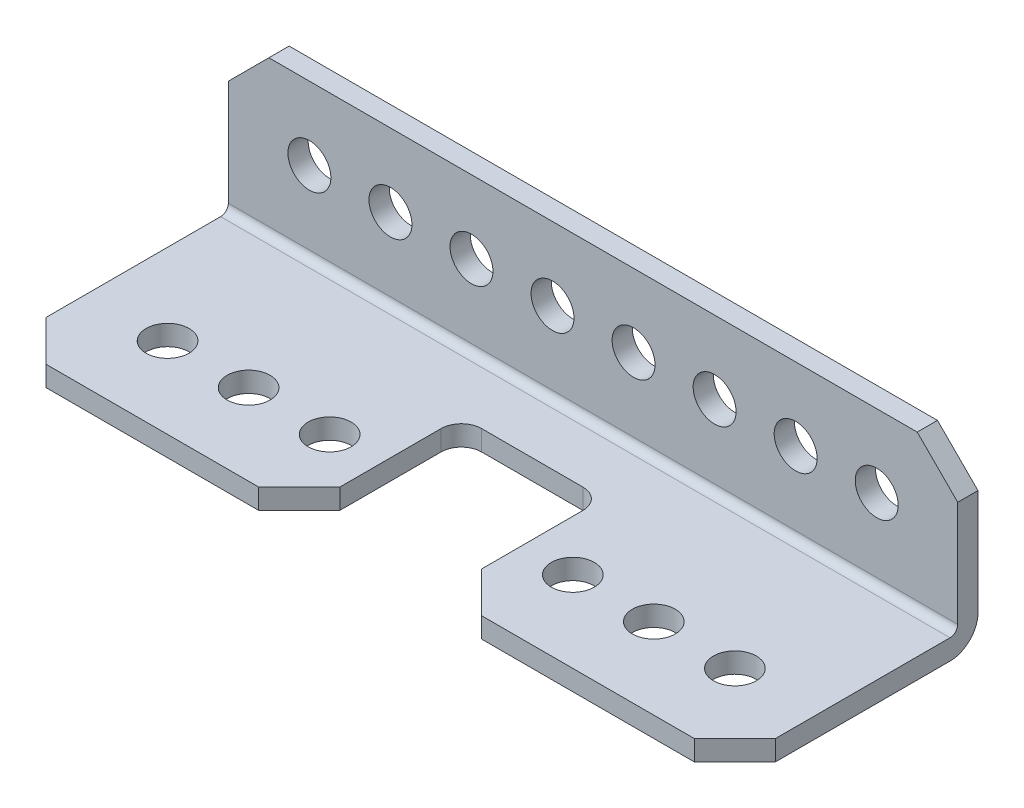
ISO-10303-21;
HEADER;
FILE_DESCRIPTION(('STEP AP214'),'2;1');
FILE_NAME('part.step','',(''),(''),'','','');
FILE_SCHEMA(('AUTOMOTIVE_DESIGN { 1 0 10303 214 1 1 1 1 }'));
ENDSEC;
DATA;
#1=APPLICATION_CONTEXT('core data for automotive mechanical design processes');
#2=APPLICATION_PROTOCOL_DEFINITION('international standard','automotive_design',2000,#1);
#3=PRODUCT_CONTEXT('',#1,'mechanical');
#4=PRODUCT('Part','Part','',(#3));
#5=PRODUCT_RELATED_PRODUCT_CATEGORY('part','',(#4));
#6=PRODUCT_DEFINITION_FORMATION('','',#4);
#7=PRODUCT_DEFINITION_CONTEXT('part definition',#1,'design');
#8=PRODUCT_DEFINITION('design','',#6,#7);
#9=PRODUCT_DEFINITION_SHAPE('','',#8);
#10=(LENGTH_UNIT() NAMED_UNIT(*) SI_UNIT(.MILLI.,.METRE.));
#11=(NAMED_UNIT(*) PLANE_ANGLE_UNIT() SI_UNIT($,.RADIAN.));
#12=(NAMED_UNIT(*) SI_UNIT($,.STERADIAN.) SOLID_ANGLE_UNIT());
#13=UNCERTAINTY_MEASURE_WITH_UNIT(LENGTH_MEASURE(1.E-05),#10,'distance_accuracy_value','');
#14=(GEOMETRIC_REPRESENTATION_CONTEXT(3) GLOBAL_UNCERTAINTY_ASSIGNED_CONTEXT((#13)) GLOBAL_UNIT_ASSIGNED_CONTEXT((#10,
#11,#12)) REPRESENTATION_CONTEXT('',''));
#15=CARTESIAN_POINT('',(0.,0.,0.));
#16=DIRECTION('',(0.,0.,1.));
#17=DIRECTION('',(1.,0.,0.));
#18=AXIS2_PLACEMENT_3D('',#15,#16,#17);
#19=CARTESIAN_POINT('',(-57.15,-12.065,0.));
#20=DIRECTION('',(0.,0.,1.));
#21=DIRECTION('',(1.,0.,0.));
#22=AXIS2_PLACEMENT_3D('',#19,#20,#21);
#23=PLANE('',#22);
#24=DIRECTION('',(0.707106781186548,-0.707106781186547,0.));
#25=VECTOR('',#24,1.);
#26=CARTESIAN_POINT('',(50.8,12.065,0.));
#27=LINE('',#26,#25);
#28=CARTESIAN_POINT('',(50.8,12.065,0.));
#29=VERTEX_POINT('',#28);
#30=CARTESIAN_POINT('',(57.15,5.71500000000001,0.));
#31=VERTEX_POINT('',#30);
#32=EDGE_CURVE('E156',#29,#31,#27,.T.);
#33=ORIENTED_EDGE('',*,*,#32,.T.);
#34=DIRECTION('',(0.,1.,0.));
#35=VECTOR('',#34,1.);
#36=CARTESIAN_POINT('',(57.15,12.065,0.));
#37=LINE('',#36,#35);
#38=CARTESIAN_POINT('',(57.15,-10.8458,0.));
#39=VERTEX_POINT('',#38);
#40=EDGE_CURVE('E150',#31,#39,#37,.F.);
#41=ORIENTED_EDGE('',*,*,#40,.T.);
#42=DIRECTION('',(1.,0.,0.));
#43=VECTOR('',#42,1.);
#44=CARTESIAN_POINT('',(57.15,-10.8458,0.));
#45=LINE('',#44,#43);
#46=CARTESIAN_POINT('',(-57.15,-10.8458,0.));
#47=VERTEX_POINT('',#46);
#48=EDGE_CURVE('E153',#47,#39,#45,.T.);
#49=ORIENTED_EDGE('',*,*,#48,.F.);
#50=DIRECTION('',(0.,1.,0.));
#51=VECTOR('',#50,1.);
#52=CARTESIAN_POINT('',(-57.15,12.065,0.));
#53=LINE('',#52,#51);
#54=CARTESIAN_POINT('',(-57.15,5.715,0.));
#55=VERTEX_POINT('',#54);
#56=EDGE_CURVE('E474',#47,#55,#53,.T.);
#57=ORIENTED_EDGE('',*,*,#56,.T.);
#58=DIRECTION('',(0.707106781186548,0.707106781186547,0.));
#59=VECTOR('',#58,1.);
#60=CARTESIAN_POINT('',(-57.15,5.715,0.));
#61=LINE('',#60,#59);
#62=CARTESIAN_POINT('',(-50.8,12.065,0.));
#63=VERTEX_POINT('',#62);
#64=EDGE_CURVE('E449',#55,#63,#61,.T.);
#65=ORIENTED_EDGE('',*,*,#64,.T.);
#66=DIRECTION('',(1.,0.,0.));
#67=VECTOR('',#66,1.);
#68=CARTESIAN_POINT('',(-57.15,12.065,0.));
#69=LINE('',#68,#67);
#70=EDGE_CURVE('E444',#63,#29,#69,.T.);
#71=ORIENTED_EDGE('',*,*,#70,.T.);
#72=EDGE_LOOP('',(#33,#41,#49,#57,#65,#71));
#73=FACE_BOUND('',#72,.T.);
#74=CARTESIAN_POINT('',(-44.45,0.634999999999998,0.));
#75=DIRECTION('',(0.,0.,1.));
#76=DIRECTION('',(1.,0.,0.));
#77=AXIS2_PLACEMENT_3D('',#74,#75,#76);
#78=CIRCLE('',#77,3.3655);
#79=CARTESIAN_POINT('',(-41.0845,0.634999999999998,0.));
#80=VERTEX_POINT('',#79);
#81=EDGE_CURVE('E160',#80,#80,#78,.T.);
#82=ORIENTED_EDGE('',*,*,#81,.T.);
#83=EDGE_LOOP('',(#82));
#84=FACE_BOUND('',#83,.T.);
#85=CARTESIAN_POINT('',(-31.75,0.634999999999998,0.));
#86=DIRECTION('',(0.,0.,1.));
#87=DIRECTION('',(1.,0.,0.));
#88=AXIS2_PLACEMENT_3D('',#85,#86,#87);
#89=CIRCLE('',#88,3.36549999999999);
#90=CARTESIAN_POINT('',(-28.3845,0.634999999999998,0.));
#91=VERTEX_POINT('',#90);
#92=EDGE_CURVE('E185',#91,#91,#89,.T.);
#93=ORIENTED_EDGE('',*,*,#92,.T.);
#94=EDGE_LOOP('',(#93));
#95=FACE_BOUND('',#94,.T.);
#96=CARTESIAN_POINT('',(-19.05,0.634999999999998,0.));
#97=DIRECTION('',(0.,0.,1.));
#98=DIRECTION('',(1.,0.,0.));
#99=AXIS2_PLACEMENT_3D('',#96,#97,#98);
#100=CIRCLE('',#99,3.3655);
#101=CARTESIAN_POINT('',(-15.6845,0.634999999999998,0.));
#102=VERTEX_POINT('',#101);
#103=EDGE_CURVE('E188',#102,#102,#100,.T.);
#104=ORIENTED_EDGE('',*,*,#103,.T.);
#105=EDGE_LOOP('',(#104));
#106=FACE_BOUND('',#105,.T.);
#107=CARTESIAN_POINT('',(-6.35,0.634999999999998,0.));
#108=DIRECTION('',(0.,0.,1.));
#109=DIRECTION('',(1.,0.,0.));
#110=AXIS2_PLACEMENT_3D('',#107,#108,#109);
#111=CIRCLE('',#110,3.3655);
#112=CARTESIAN_POINT('',(-2.9845,0.634999999999998,0.));
#113=VERTEX_POINT('',#112);
#114=EDGE_CURVE('E191',#113,#113,#111,.T.);
#115=ORIENTED_EDGE('',*,*,#114,.T.);
#116=EDGE_LOOP('',(#115));
#117=FACE_BOUND('',#116,.T.);
#118=CARTESIAN_POINT('',(6.35,0.634999999999998,0.));
#119=DIRECTION('',(0.,0.,1.));
#120=DIRECTION('',(1.,0.,0.));
#121=AXIS2_PLACEMENT_3D('',#118,#119,#120);
#122=CIRCLE('',#121,3.3655);
#123=CARTESIAN_POINT('',(9.7155,0.634999999999998,0.));
#124=VERTEX_POINT('',#123);
#125=EDGE_CURVE('E194',#124,#124,#122,.T.);
#126=ORIENTED_EDGE('',*,*,#125,.T.);
#127=EDGE_LOOP('',(#126));
#128=FACE_BOUND('',#127,.T.);
#129=CARTESIAN_POINT('',(19.05,0.634999999999998,0.));
#130=DIRECTION('',(0.,0.,1.));
#131=DIRECTION('',(1.,0.,0.));
#132=AXIS2_PLACEMENT_3D('',#129,#130,#131);
#133=CIRCLE('',#132,3.3655);
#134=CARTESIAN_POINT('',(22.4155,0.634999999999998,0.));
#135=VERTEX_POINT('',#134);
#136=EDGE_CURVE('E197',#135,#135,#133,.T.);
#137=ORIENTED_EDGE('',*,*,#136,.T.);
#138=EDGE_LOOP('',(#137));
#139=FACE_BOUND('',#138,.T.);
#140=CARTESIAN_POINT('',(31.75,0.634999999999998,0.));
#141=DIRECTION('',(0.,0.,1.));
#142=DIRECTION('',(1.,0.,0.));
#143=AXIS2_PLACEMENT_3D('',#140,#141,#142);
#144=CIRCLE('',#143,3.3655);
#145=CARTESIAN_POINT('',(35.1155,0.634999999999998,0.));
#146=VERTEX_POINT('',#145);
#147=EDGE_CURVE('E199',#146,#146,#144,.T.);
#148=ORIENTED_EDGE('',*,*,#147,.T.);
#149=EDGE_LOOP('',(#148));
#150=FACE_BOUND('',#149,.T.);
#151=CARTESIAN_POINT('',(44.45,0.634999999999998,0.));
#152=DIRECTION('',(0.,0.,1.));
#153=DIRECTION('',(1.,0.,0.));
#154=AXIS2_PLACEMENT_3D('',#151,#152,#153);
#155=CIRCLE('',#154,3.3655);
#156=CARTESIAN_POINT('',(47.8155,0.634999999999998,0.));
#157=VERTEX_POINT('',#156);
#158=EDGE_CURVE('E20',#157,#157,#155,.T.);
#159=ORIENTED_EDGE('',*,*,#158,.T.);
#160=EDGE_LOOP('',(#159));
#161=FACE_BOUND('',#160,.T.);
#162=ADVANCED_FACE('F17',(#73,#84,#95,#106,#117,#128,#139,#150,#161),#23,.F.);
#163=CARTESIAN_POINT('',(44.45,0.634999999999998,0.));
#164=DIRECTION('',(0.,0.,1.));
#165=DIRECTION('',(1.,0.,0.));
#166=AXIS2_PLACEMENT_3D('',#163,#164,#165);
#167=CYLINDRICAL_SURFACE('',#166,3.3655);
#168=CARTESIAN_POINT('',(44.45,0.634999999999998,3.175));
#169=DIRECTION('',(0.,0.,1.));
#170=DIRECTION('',(1.,0.,0.));
#171=AXIS2_PLACEMENT_3D('',#168,#169,#170);
#172=CIRCLE('',#171,3.3655);
#173=CARTESIAN_POINT('',(47.8155,0.634999999999998,3.175));
#174=VERTEX_POINT('',#173);
#175=EDGE_CURVE('E176',#174,#174,#172,.F.);
#176=ORIENTED_EDGE('',*,*,#175,.F.);
#177=EDGE_LOOP('',(#176));
#178=FACE_BOUND('',#177,.T.);
#179=ORIENTED_EDGE('',*,*,#158,.F.);
#180=EDGE_LOOP('',(#179));
#181=FACE_BOUND('',#180,.T.);
#182=ADVANCED_FACE('F207',(#178,#181),#167,.F.);
#183=CARTESIAN_POINT('',(31.75,0.634999999999998,0.));
#184=DIRECTION('',(0.,0.,1.));
#185=DIRECTION('',(1.,0.,0.));
#186=AXIS2_PLACEMENT_3D('',#183,#184,#185);
#187=CYLINDRICAL_SURFACE('',#186,3.3655);
#188=CARTESIAN_POINT('',(31.75,0.634999999999998,3.175));
#189=DIRECTION('',(0.,0.,1.));
#190=DIRECTION('',(1.,0.,0.));
#191=AXIS2_PLACEMENT_3D('',#188,#189,#190);
#192=CIRCLE('',#191,3.3655);
#193=CARTESIAN_POINT('',(35.1155,0.634999999999998,3.175));
#194=VERTEX_POINT('',#193);
#195=EDGE_CURVE('E179',#194,#194,#192,.F.);
#196=ORIENTED_EDGE('',*,*,#195,.F.);
#197=EDGE_LOOP('',(#196));
#198=FACE_BOUND('',#197,.T.);
#199=ORIENTED_EDGE('',*,*,#147,.F.);
#200=EDGE_LOOP('',(#199));
#201=FACE_BOUND('',#200,.T.);
#202=ADVANCED_FACE('F209',(#198,#201),#187,.F.);
#203=CARTESIAN_POINT('',(19.05,0.634999999999998,0.));
#204=DIRECTION('',(0.,0.,1.));
#205=DIRECTION('',(1.,0.,0.));
#206=AXIS2_PLACEMENT_3D('',#203,#204,#205);
#207=CYLINDRICAL_SURFACE('',#206,3.3655);
#208=CARTESIAN_POINT('',(19.05,0.634999999999998,3.175));
#209=DIRECTION('',(0.,0.,1.));
#210=DIRECTION('',(1.,0.,0.));
#211=AXIS2_PLACEMENT_3D('',#208,#209,#210);
#212=CIRCLE('',#211,3.3655);
#213=CARTESIAN_POINT('',(22.4155,0.634999999999998,3.175));
#214=VERTEX_POINT('',#213);
#215=EDGE_CURVE('E354',#214,#214,#212,.F.);
#216=ORIENTED_EDGE('',*,*,#215,.F.);
#217=EDGE_LOOP('',(#216));
#218=FACE_BOUND('',#217,.T.);
#219=ORIENTED_EDGE('',*,*,#136,.F.);
#220=EDGE_LOOP('',(#219));
#221=FACE_BOUND('',#220,.T.);
#222=ADVANCED_FACE('F216',(#218,#221),#207,.F.);
#223=CARTESIAN_POINT('',(6.35,0.634999999999998,0.));
#224=DIRECTION('',(0.,0.,1.));
#225=DIRECTION('',(1.,0.,0.));
#226=AXIS2_PLACEMENT_3D('',#223,#224,#225);
#227=CYLINDRICAL_SURFACE('',#226,3.3655);
#228=CARTESIAN_POINT('',(6.35,0.634999999999998,3.175));
#229=DIRECTION('',(0.,0.,1.));
#230=DIRECTION('',(1.,0.,0.));
#231=AXIS2_PLACEMENT_3D('',#228,#229,#230);
#232=CIRCLE('',#231,3.3655);
#233=CARTESIAN_POINT('',(9.7155,0.634999999999998,3.175));
#234=VERTEX_POINT('',#233);
#235=EDGE_CURVE('E358',#234,#234,#232,.F.);
#236=ORIENTED_EDGE('',*,*,#235,.F.);
#237=EDGE_LOOP('',(#236));
#238=FACE_BOUND('',#237,.T.);
#239=ORIENTED_EDGE('',*,*,#125,.F.);
#240=EDGE_LOOP('',(#239));
#241=FACE_BOUND('',#240,.T.);
#242=ADVANCED_FACE('F342',(#238,#241),#227,.F.);
#243=CARTESIAN_POINT('',(-6.35,0.634999999999998,0.));
#244=DIRECTION('',(0.,0.,1.));
#245=DIRECTION('',(1.,0.,0.));
#246=AXIS2_PLACEMENT_3D('',#243,#244,#245);
#247=CYLINDRICAL_SURFACE('',#246,3.3655);
#248=CARTESIAN_POINT('',(-6.35,0.634999999999998,3.175));
#249=DIRECTION('',(0.,0.,1.));
#250=DIRECTION('',(1.,0.,0.));
#251=AXIS2_PLACEMENT_3D('',#248,#249,#250);
#252=CIRCLE('',#251,3.3655);
#253=CARTESIAN_POINT('',(-2.9845,0.634999999999998,3.175));
#254=VERTEX_POINT('',#253);
#255=EDGE_CURVE('E361',#254,#254,#252,.F.);
#256=ORIENTED_EDGE('',*,*,#255,.F.);
#257=EDGE_LOOP('',(#256));
#258=FACE_BOUND('',#257,.T.);
#259=ORIENTED_EDGE('',*,*,#114,.F.);
#260=EDGE_LOOP('',(#259));
#261=FACE_BOUND('',#260,.T.);
#262=ADVANCED_FACE('F338',(#258,#261),#247,.F.);
#263=CARTESIAN_POINT('',(-19.05,0.634999999999998,0.));
#264=DIRECTION('',(0.,0.,1.));
#265=DIRECTION('',(1.,0.,0.));
#266=AXIS2_PLACEMENT_3D('',#263,#264,#265);
#267=CYLINDRICAL_SURFACE('',#266,3.3655);
#268=CARTESIAN_POINT('',(-19.05,0.634999999999998,3.175));
#269=DIRECTION('',(0.,0.,1.));
#270=DIRECTION('',(1.,0.,0.));
#271=AXIS2_PLACEMENT_3D('',#268,#269,#270);
#272=CIRCLE('',#271,3.3655);
#273=CARTESIAN_POINT('',(-15.6845,0.634999999999998,3.175));
#274=VERTEX_POINT('',#273);
#275=EDGE_CURVE('E367',#274,#274,#272,.F.);
#276=ORIENTED_EDGE('',*,*,#275,.F.);
#277=EDGE_LOOP('',(#276));
#278=FACE_BOUND('',#277,.T.);
#279=ORIENTED_EDGE('',*,*,#103,.F.);
#280=EDGE_LOOP('',(#279));
#281=FACE_BOUND('',#280,.T.);
#282=ADVANCED_FACE('F334',(#278,#281),#267,.F.);
#283=CARTESIAN_POINT('',(-31.75,0.634999999999998,0.));
#284=DIRECTION('',(0.,0.,1.));
#285=DIRECTION('',(1.,0.,0.));
#286=AXIS2_PLACEMENT_3D('',#283,#284,#285);
#287=CYLINDRICAL_SURFACE('',#286,3.36549999999999);
#288=CARTESIAN_POINT('',(-31.75,0.634999999999998,3.175));
#289=DIRECTION('',(0.,0.,1.));
#290=DIRECTION('',(1.,0.,0.));
#291=AXIS2_PLACEMENT_3D('',#288,#289,#290);
#292=CIRCLE('',#291,3.36549999999999);
#293=CARTESIAN_POINT('',(-28.3845,0.634999999999998,3.175));
#294=VERTEX_POINT('',#293);
#295=EDGE_CURVE('E370',#294,#294,#292,.F.);
#296=ORIENTED_EDGE('',*,*,#295,.F.);
#297=EDGE_LOOP('',(#296));
#298=FACE_BOUND('',#297,.T.);
#299=ORIENTED_EDGE('',*,*,#92,.F.);
#300=EDGE_LOOP('',(#299));
#301=FACE_BOUND('',#300,.T.);
#302=ADVANCED_FACE('F330',(#298,#301),#287,.F.);
#303=CARTESIAN_POINT('',(-44.45,0.634999999999998,0.));
#304=DIRECTION('',(0.,0.,1.));
#305=DIRECTION('',(1.,0.,0.));
#306=AXIS2_PLACEMENT_3D('',#303,#304,#305);
#307=CYLINDRICAL_SURFACE('',#306,3.3655);
#308=CARTESIAN_POINT('',(-44.45,0.634999999999998,3.175));
#309=DIRECTION('',(0.,0.,1.));
#310=DIRECTION('',(1.,0.,0.));
#311=AXIS2_PLACEMENT_3D('',#308,#309,#310);
#312=CIRCLE('',#311,3.3655);
#313=CARTESIAN_POINT('',(-41.0845,0.634999999999998,3.175));
#314=VERTEX_POINT('',#313);
#315=EDGE_CURVE('E373',#314,#314,#312,.F.);
#316=ORIENTED_EDGE('',*,*,#315,.F.);
#317=EDGE_LOOP('',(#316));
#318=FACE_BOUND('',#317,.T.);
#319=ORIENTED_EDGE('',*,*,#81,.F.);
#320=EDGE_LOOP('',(#319));
#321=FACE_BOUND('',#320,.T.);
#322=ADVANCED_FACE('F326',(#318,#321),#307,.F.);
#323=CARTESIAN_POINT('',(50.8,12.065,3.175));
#324=DIRECTION('',(-0.707106781186547,-0.707106781186548,0.));
#325=DIRECTION('',(0.707106781186548,-0.707106781186547,0.));
#326=AXIS2_PLACEMENT_3D('',#323,#324,#325);
#327=PLANE('',#326);
#328=DIRECTION('',(0.,0.,1.));
#329=VECTOR('',#328,1.);
#330=CARTESIAN_POINT('',(57.15,5.715,3.175));
#331=LINE('',#330,#329);
#332=CARTESIAN_POINT('',(57.15,5.715,3.175));
#333=VERTEX_POINT('',#332);
#334=EDGE_CURVE('E441',#31,#333,#331,.T.);
#335=ORIENTED_EDGE('',*,*,#334,.F.);
#336=ORIENTED_EDGE('',*,*,#32,.F.);
#337=DIRECTION('',(0.,0.,-1.));
#338=VECTOR('',#337,1.);
#339=CARTESIAN_POINT('',(50.8,12.065,3.175));
#340=LINE('',#339,#338);
#341=CARTESIAN_POINT('',(50.8,12.065,3.175));
#342=VERTEX_POINT('',#341);
#343=EDGE_CURVE('E446',#29,#342,#340,.F.);
#344=ORIENTED_EDGE('',*,*,#343,.T.);
#345=DIRECTION('',(-0.707106781186548,0.707106781186547,0.));
#346=VECTOR('',#345,1.);
#347=CARTESIAN_POINT('',(57.15,5.71500000000001,3.175));
#348=LINE('',#347,#346);
#349=EDGE_CURVE('E459',#333,#342,#348,.T.);
#350=ORIENTED_EDGE('',*,*,#349,.F.);
#351=EDGE_LOOP('',(#335,#336,#344,#350));
#352=FACE_BOUND('',#351,.T.);
#353=ADVANCED_FACE('F322',(#352),#327,.F.);
#354=CARTESIAN_POINT('',(-57.15,12.065,3.175));
#355=DIRECTION('',(0.,-1.,0.));
#356=DIRECTION('',(0.,0.,-1.));
#357=AXIS2_PLACEMENT_3D('',#354,#355,#356);
#358=PLANE('',#357);
#359=ORIENTED_EDGE('',*,*,#343,.F.);
#360=ORIENTED_EDGE('',*,*,#70,.F.);
#361=DIRECTION('',(0.,0.,1.));
#362=VECTOR('',#361,1.);
#363=CARTESIAN_POINT('',(-50.8,12.065,3.175));
#364=LINE('',#363,#362);
#365=CARTESIAN_POINT('',(-50.8,12.065,3.175));
#366=VERTEX_POINT('',#365);
#367=EDGE_CURVE('E451',#63,#366,#364,.T.);
#368=ORIENTED_EDGE('',*,*,#367,.T.);
#369=DIRECTION('',(1.,0.,0.));
#370=VECTOR('',#369,1.);
#371=CARTESIAN_POINT('',(-57.15,12.065,3.175));
#372=LINE('',#371,#370);
#373=EDGE_CURVE('E462',#342,#366,#372,.F.);
#374=ORIENTED_EDGE('',*,*,#373,.F.);
#375=EDGE_LOOP('',(#359,#360,#368,#374));
#376=FACE_BOUND('',#375,.T.);
#377=ADVANCED_FACE('F318',(#376),#358,.F.);
#378=CARTESIAN_POINT('',(-57.15,5.715,3.175));
#379=DIRECTION('',(0.707106781186547,-0.707106781186548,0.));
#380=DIRECTION('',(0.707106781186548,0.707106781186547,0.));
#381=AXIS2_PLACEMENT_3D('',#378,#379,#380);
#382=PLANE('',#381);
#383=ORIENTED_EDGE('',*,*,#367,.F.);
#384=ORIENTED_EDGE('',*,*,#64,.F.);
#385=DIRECTION('',(0.,0.,-1.));
#386=VECTOR('',#385,1.);
#387=CARTESIAN_POINT('',(-57.15,5.715,3.175));
#388=LINE('',#387,#386);
#389=CARTESIAN_POINT('',(-57.15,5.715,3.175));
#390=VERTEX_POINT('',#389);
#391=EDGE_CURVE('E170',#55,#390,#388,.F.);
#392=ORIENTED_EDGE('',*,*,#391,.T.);
#393=DIRECTION('',(-0.707106781186548,-0.707106781186547,0.));
#394=VECTOR('',#393,1.);
#395=CARTESIAN_POINT('',(-50.8,12.065,3.175));
#396=LINE('',#395,#394);
#397=EDGE_CURVE('E470',#366,#390,#396,.T.);
#398=ORIENTED_EDGE('',*,*,#397,.F.);
#399=EDGE_LOOP('',(#383,#384,#392,#398));
#400=FACE_BOUND('',#399,.T.);
#401=ADVANCED_FACE('F315',(#400),#382,.F.);
#402=CARTESIAN_POINT('',(57.15,-10.8458,4.3942));
#403=DIRECTION('',(1.,0.,0.));
#404=DIRECTION('',(0.,0.,-1.));
#405=AXIS2_PLACEMENT_3D('',#402,#403,#404);
#406=CYLINDRICAL_SURFACE('',#405,4.3942);
#407=DIRECTION('',(1.,0.,0.));
#408=VECTOR('',#407,1.);
#409=CARTESIAN_POINT('',(-57.15,-15.24,4.39419999999999));
#410=LINE('',#409,#408);
#411=CARTESIAN_POINT('',(57.15,-15.24,4.39419999999999));
#412=VERTEX_POINT('',#411);
#413=CARTESIAN_POINT('',(-57.15,-15.24,4.39419999999999));
#414=VERTEX_POINT('',#413);
#415=EDGE_CURVE('E378',#412,#414,#410,.F.);
#416=ORIENTED_EDGE('',*,*,#415,.T.);
#417=CARTESIAN_POINT('',(-57.15,-10.8458,4.3942));
#418=DIRECTION('',(1.,0.,0.));
#419=DIRECTION('',(0.,0.,-1.));
#420=AXIS2_PLACEMENT_3D('',#417,#418,#419);
#421=CIRCLE('',#420,4.3942);
#422=EDGE_CURVE('E169',#47,#414,#421,.F.);
#423=ORIENTED_EDGE('',*,*,#422,.F.);
#424=ORIENTED_EDGE('',*,*,#48,.T.);
#425=CARTESIAN_POINT('',(57.15,-10.8458,4.3942));
#426=DIRECTION('',(1.,0.,0.));
#427=DIRECTION('',(0.,0.,-1.));
#428=AXIS2_PLACEMENT_3D('',#425,#426,#427);
#429=CIRCLE('',#428,4.3942);
#430=EDGE_CURVE('E166',#39,#412,#429,.F.);
#431=ORIENTED_EDGE('',*,*,#430,.T.);
#432=EDGE_LOOP('',(#416,#423,#424,#431));
#433=FACE_BOUND('',#432,.T.);
#434=ADVANCED_FACE('F165',(#433),#406,.T.);
#435=CARTESIAN_POINT('',(-57.15,-12.065,3.175));
#436=DIRECTION('',(0.,0.,1.));
#437=DIRECTION('',(1.,0.,0.));
#438=AXIS2_PLACEMENT_3D('',#435,#436,#437);
#439=PLANE('',#438);
#440=DIRECTION('',(0.,1.,0.));
#441=VECTOR('',#440,1.);
#442=CARTESIAN_POINT('',(-57.15,-12.065,3.175));
#443=LINE('',#442,#441);
#444=CARTESIAN_POINT('',(-57.15,-10.8458,3.175));
#445=VERTEX_POINT('',#444);
#446=EDGE_CURVE('E379',#390,#445,#443,.F.);
#447=ORIENTED_EDGE('',*,*,#446,.T.);
#448=DIRECTION('',(1.,0.,0.));
#449=VECTOR('',#448,1.);
#450=CARTESIAN_POINT('',(57.15,-10.8458,3.175));
#451=LINE('',#450,#449);
#452=CARTESIAN_POINT('',(57.15,-10.8458,3.175));
#453=VERTEX_POINT('',#452);
#454=EDGE_CURVE('E393',#445,#453,#451,.T.);
#455=ORIENTED_EDGE('',*,*,#454,.T.);
#456=DIRECTION('',(0.,1.,0.));
#457=VECTOR('',#456,1.);
#458=CARTESIAN_POINT('',(57.15,-12.065,3.175));
#459=LINE('',#458,#457);
#460=EDGE_CURVE('E376',#453,#333,#459,.T.);
#461=ORIENTED_EDGE('',*,*,#460,.T.);
#462=ORIENTED_EDGE('',*,*,#349,.T.);
#463=ORIENTED_EDGE('',*,*,#373,.T.);
#464=ORIENTED_EDGE('',*,*,#397,.T.);
#465=EDGE_LOOP('',(#447,#455,#461,#462,#463,#464));
#466=FACE_BOUND('',#465,.T.);
#467=ORIENTED_EDGE('',*,*,#315,.T.);
#468=EDGE_LOOP('',(#467));
#469=FACE_BOUND('',#468,.T.);
#470=ORIENTED_EDGE('',*,*,#295,.T.);
#471=EDGE_LOOP('',(#470));
#472=FACE_BOUND('',#471,.T.);
#473=ORIENTED_EDGE('',*,*,#275,.T.);
#474=EDGE_LOOP('',(#473));
#475=FACE_BOUND('',#474,.T.);
#476=ORIENTED_EDGE('',*,*,#255,.T.);
#477=EDGE_LOOP('',(#476));
#478=FACE_BOUND('',#477,.T.);
#479=ORIENTED_EDGE('',*,*,#235,.T.);
#480=EDGE_LOOP('',(#479));
#481=FACE_BOUND('',#480,.T.);
#482=ORIENTED_EDGE('',*,*,#215,.T.);
#483=EDGE_LOOP('',(#482));
#484=FACE_BOUND('',#483,.T.);
#485=ORIENTED_EDGE('',*,*,#195,.T.);
#486=EDGE_LOOP('',(#485));
#487=FACE_BOUND('',#486,.T.);
#488=ORIENTED_EDGE('',*,*,#175,.T.);
#489=EDGE_LOOP('',(#488));
#490=FACE_BOUND('',#489,.T.);
#491=ADVANCED_FACE('F308',(#466,#469,#472,#475,#478,#481,#484,#487,#490),#439,.T.);
#492=CARTESIAN_POINT('',(-57.15,-15.2400000000001,38.1));
#493=DIRECTION('',(0.,1.,0.));
#494=DIRECTION('',(0.,0.,1.));
#495=AXIS2_PLACEMENT_3D('',#492,#493,#494);
#496=PLANE('',#495);
#497=DIRECTION('',(-0.707106781186547,0.,0.707106781186548));
#498=VECTOR('',#497,1.);
#499=CARTESIAN_POINT('',(-17.4625,-15.2400000000001,38.1));
#500=LINE('',#499,#498);
#501=CARTESIAN_POINT('',(-11.1125,-15.2400000000001,31.75));
#502=VERTEX_POINT('',#501);
#503=CARTESIAN_POINT('',(-17.4625,-15.2400000000001,38.1));
#504=VERTEX_POINT('',#503);
#505=EDGE_CURVE('E487',#502,#504,#500,.T.);
#506=ORIENTED_EDGE('',*,*,#505,.T.);
#507=DIRECTION('',(1.,0.,0.));
#508=VECTOR('',#507,1.);
#509=CARTESIAN_POINT('',(-57.15,-15.2400000000001,38.1));
#510=LINE('',#509,#508);
#511=CARTESIAN_POINT('',(-50.8,-15.2400000000001,38.1));
#512=VERTEX_POINT('',#511);
#513=EDGE_CURVE('E543',#504,#512,#510,.F.);
#514=ORIENTED_EDGE('',*,*,#513,.T.);
#515=DIRECTION('',(-0.707106781186548,0.,-0.707106781186548));
#516=VECTOR('',#515,1.);
#517=CARTESIAN_POINT('',(-57.15,-15.2400000000001,31.75));
#518=LINE('',#517,#516);
#519=CARTESIAN_POINT('',(-57.15,-15.2400000000001,31.75));
#520=VERTEX_POINT('',#519);
#521=EDGE_CURVE('E398',#512,#520,#518,.T.);
#522=ORIENTED_EDGE('',*,*,#521,.T.);
#523=DIRECTION('',(0.,0.,-1.));
#524=VECTOR('',#523,1.);
#525=CARTESIAN_POINT('',(-57.15,-15.2400000000001,3.17499999999999));
#526=LINE('',#525,#524);
#527=EDGE_CURVE('E532',#520,#414,#526,.T.);
#528=ORIENTED_EDGE('',*,*,#527,.T.);
#529=ORIENTED_EDGE('',*,*,#415,.F.);
#530=DIRECTION('',(0.,0.,1.));
#531=VECTOR('',#530,1.);
#532=CARTESIAN_POINT('',(57.15,-15.24,38.1));
#533=LINE('',#532,#531);
#534=CARTESIAN_POINT('',(57.15,-15.2400000000001,31.75));
#535=VERTEX_POINT('',#534);
#536=EDGE_CURVE('E175',#412,#535,#533,.T.);
#537=ORIENTED_EDGE('',*,*,#536,.T.);
#538=DIRECTION('',(-0.707106781186548,0.,0.707106781186547));
#539=VECTOR('',#538,1.);
#540=CARTESIAN_POINT('',(50.8,-15.2400000000001,38.1));
#541=LINE('',#540,#539);
#542=CARTESIAN_POINT('',(50.8,-15.2400000000001,38.1));
#543=VERTEX_POINT('',#542);
#544=EDGE_CURVE('E520',#535,#543,#541,.T.);
#545=ORIENTED_EDGE('',*,*,#544,.T.);
#546=DIRECTION('',(1.,0.,0.));
#547=VECTOR('',#546,1.);
#548=CARTESIAN_POINT('',(-57.15,-15.2400000000001,38.1));
#549=LINE('',#548,#547);
#550=CARTESIAN_POINT('',(17.4625,-15.2400000000001,38.1));
#551=VERTEX_POINT('',#550);
#552=EDGE_CURVE('E503',#543,#551,#549,.F.);
#553=ORIENTED_EDGE('',*,*,#552,.T.);
#554=DIRECTION('',(-0.707106781186547,0.,-0.707106781186548));
#555=VECTOR('',#554,1.);
#556=CARTESIAN_POINT('',(17.4625,-15.2400000000001,38.1));
#557=LINE('',#556,#555);
#558=CARTESIAN_POINT('',(11.1125,-15.2400000000001,31.75));
#559=VERTEX_POINT('',#558);
#560=EDGE_CURVE('E512',#551,#559,#557,.T.);
#561=ORIENTED_EDGE('',*,*,#560,.T.);
#562=DIRECTION('',(0.,0.,-1.));
#563=VECTOR('',#562,1.);
#564=CARTESIAN_POINT('',(11.1125,-15.2400000000001,38.1000000000001));
#565=LINE('',#564,#563);
#566=CARTESIAN_POINT('',(11.1125,-15.2400000000001,15.875));
#567=VERTEX_POINT('',#566);
#568=EDGE_CURVE('E517',#559,#567,#565,.T.);
#569=ORIENTED_EDGE('',*,*,#568,.T.);
#570=CARTESIAN_POINT('',(7.93750000000001,-15.24,15.875));
#571=DIRECTION('',(0.,1.,0.));
#572=DIRECTION('',(0.,0.,1.));
#573=AXIS2_PLACEMENT_3D('',#570,#571,#572);
#574=CIRCLE('',#573,3.175);
#575=CARTESIAN_POINT('',(7.93750000000001,-15.24,12.7));
#576=VERTEX_POINT('',#575);
#577=EDGE_CURVE('E384',#567,#576,#574,.T.);
#578=ORIENTED_EDGE('',*,*,#577,.T.);
#579=DIRECTION('',(1.,0.,0.));
#580=VECTOR('',#579,1.);
#581=CARTESIAN_POINT('',(-11.1125,-15.24,12.7));
#582=LINE('',#581,#580);
#583=CARTESIAN_POINT('',(-7.93750000000001,-15.24,12.7));
#584=VERTEX_POINT('',#583);
#585=EDGE_CURVE('E387',#576,#584,#582,.F.);
#586=ORIENTED_EDGE('',*,*,#585,.T.);
#587=CARTESIAN_POINT('',(-7.93750000000001,-15.24,15.875));
#588=DIRECTION('',(0.,1.,0.));
#589=DIRECTION('',(0.,0.,1.));
#590=AXIS2_PLACEMENT_3D('',#587,#588,#589);
#591=CIRCLE('',#590,3.175);
#592=CARTESIAN_POINT('',(-11.1125,-15.24,15.875));
#593=VERTEX_POINT('',#592);
#594=EDGE_CURVE('E380',#584,#593,#591,.T.);
#595=ORIENTED_EDGE('',*,*,#594,.T.);
#596=DIRECTION('',(0.,0.,1.));
#597=VECTOR('',#596,1.);
#598=CARTESIAN_POINT('',(-11.1125,-15.24,38.1000000000001));
#599=LINE('',#598,#597);
#600=EDGE_CURVE('E383',#593,#502,#599,.T.);
#601=ORIENTED_EDGE('',*,*,#600,.T.);
#602=EDGE_LOOP('',(#506,#514,#522,#528,#529,#537,#545,#553,#561,#569,#578,#586,#595,#601));
#603=FACE_BOUND('',#602,.T.);
#604=CARTESIAN_POINT('',(-44.45,-15.2400000000002,25.3999999999999));
#605=DIRECTION('',(0.,1.,0.));
#606=DIRECTION('',(0.,0.,1.));
#607=AXIS2_PLACEMENT_3D('',#604,#605,#606);
#608=CIRCLE('',#607,3.36549999999999);
#609=CARTESIAN_POINT('',(-44.45,-15.2400000000002,28.7654999999999));
#610=VERTEX_POINT('',#609);
#611=EDGE_CURVE('E410',#610,#610,#608,.T.);
#612=ORIENTED_EDGE('',*,*,#611,.T.);
#613=EDGE_LOOP('',(#612));
#614=FACE_BOUND('',#613,.T.);
#615=CARTESIAN_POINT('',(-31.75,-15.2400000000002,25.3999999999999));
#616=DIRECTION('',(0.,1.,0.));
#617=DIRECTION('',(0.,0.,1.));
#618=AXIS2_PLACEMENT_3D('',#615,#616,#617);
#619=CIRCLE('',#618,3.36549999999999);
#620=CARTESIAN_POINT('',(-31.75,-15.2400000000002,28.7654999999999));
#621=VERTEX_POINT('',#620);
#622=EDGE_CURVE('E407',#621,#621,#619,.T.);
#623=ORIENTED_EDGE('',*,*,#622,.T.);
#624=EDGE_LOOP('',(#623));
#625=FACE_BOUND('',#624,.T.);
#626=CARTESIAN_POINT('',(-19.05,-15.2400000000002,25.3999999999999));
#627=DIRECTION('',(0.,1.,0.));
#628=DIRECTION('',(0.,0.,1.));
#629=AXIS2_PLACEMENT_3D('',#626,#627,#628);
#630=CIRCLE('',#629,3.36549999999999);
#631=CARTESIAN_POINT('',(-19.05,-15.2400000000002,28.7654999999999));
#632=VERTEX_POINT('',#631);
#633=EDGE_CURVE('E404',#632,#632,#630,.T.);
#634=ORIENTED_EDGE('',*,*,#633,.T.);
#635=EDGE_LOOP('',(#634));
#636=FACE_BOUND('',#635,.T.);
#637=CARTESIAN_POINT('',(19.05,-15.2400000000002,25.3999999999999));
#638=DIRECTION('',(0.,1.,0.));
#639=DIRECTION('',(0.,0.,1.));
#640=AXIS2_PLACEMENT_3D('',#637,#638,#639);
#641=CIRCLE('',#640,3.36549999999999);
#642=CARTESIAN_POINT('',(19.05,-15.2400000000002,28.7654999999999));
#643=VERTEX_POINT('',#642);
#644=EDGE_CURVE('E401',#643,#643,#641,.T.);
#645=ORIENTED_EDGE('',*,*,#644,.T.);
#646=EDGE_LOOP('',(#645));
#647=FACE_BOUND('',#646,.T.);
#648=CARTESIAN_POINT('',(31.75,-15.2400000000002,25.3999999999999));
#649=DIRECTION('',(0.,1.,0.));
#650=DIRECTION('',(0.,0.,1.));
#651=AXIS2_PLACEMENT_3D('',#648,#649,#650);
#652=CIRCLE('',#651,3.36549999999999);
#653=CARTESIAN_POINT('',(31.75,-15.2400000000002,28.7654999999999));
#654=VERTEX_POINT('',#653);
#655=EDGE_CURVE('E397',#654,#654,#652,.T.);
#656=ORIENTED_EDGE('',*,*,#655,.T.);
#657=EDGE_LOOP('',(#656));
#658=FACE_BOUND('',#657,.T.);
#659=CARTESIAN_POINT('',(44.45,-15.2400000000002,25.3999999999999));
#660=DIRECTION('',(0.,1.,0.));
#661=DIRECTION('',(0.,0.,1.));
#662=AXIS2_PLACEMENT_3D('',#659,#660,#661);
#663=CIRCLE('',#662,3.36549999999999);
#664=CARTESIAN_POINT('',(44.45,-15.2400000000002,28.7654999999999));
#665=VERTEX_POINT('',#664);
#666=EDGE_CURVE('E394',#665,#665,#663,.T.);
#667=ORIENTED_EDGE('',*,*,#666,.T.);
#668=EDGE_LOOP('',(#667));
#669=FACE_BOUND('',#668,.T.);
#670=ADVANCED_FACE('F304',(#603,#614,#625,#636,#647,#658,#669),#496,.F.);
#671=CARTESIAN_POINT('',(-57.15,-15.2400000000001,38.1));
#672=DIRECTION('',(0.,0.,-1.));
#673=DIRECTION('',(0.,1.,0.));
#674=AXIS2_PLACEMENT_3D('',#671,#672,#673);
#675=PLANE('',#674);
#676=DIRECTION('',(0.,1.,0.));
#677=VECTOR('',#676,1.);
#678=CARTESIAN_POINT('',(-17.4625,-15.2400000000001,38.1));
#679=LINE('',#678,#677);
#680=CARTESIAN_POINT('',(-17.4625,-12.0650000000001,38.1));
#681=VERTEX_POINT('',#680);
#682=EDGE_CURVE('E491',#504,#681,#679,.T.);
#683=ORIENTED_EDGE('',*,*,#682,.T.);
#684=DIRECTION('',(1.,0.,0.));
#685=VECTOR('',#684,1.);
#686=CARTESIAN_POINT('',(-57.15,-12.0650000000001,38.1));
#687=LINE('',#686,#685);
#688=CARTESIAN_POINT('',(-50.8,-12.0650000000001,38.1));
#689=VERTEX_POINT('',#688);
#690=EDGE_CURVE('E413',#689,#681,#687,.T.);
#691=ORIENTED_EDGE('',*,*,#690,.F.);
#692=DIRECTION('',(0.,1.,0.));
#693=VECTOR('',#692,1.);
#694=CARTESIAN_POINT('',(-50.8,-15.2400000000001,38.1));
#695=LINE('',#694,#693);
#696=EDGE_CURVE('E550',#689,#512,#695,.F.);
#697=ORIENTED_EDGE('',*,*,#696,.T.);
#698=ORIENTED_EDGE('',*,*,#513,.F.);
#699=EDGE_LOOP('',(#683,#691,#697,#698));
#700=FACE_BOUND('',#699,.T.);
#701=ADVANCED_FACE('F300',(#700),#675,.F.);
#702=CARTESIAN_POINT('',(-17.4625,-15.2400000000001,38.1));
#703=DIRECTION('',(-0.707106781186548,0.,-0.707106781186547));
#704=DIRECTION('',(-0.707106781186547,0.,0.707106781186548));
#705=AXIS2_PLACEMENT_3D('',#702,#703,#704);
#706=PLANE('',#705);
#707=DIRECTION('',(0.,1.,0.));
#708=VECTOR('',#707,1.);
#709=CARTESIAN_POINT('',(-11.1125,12.065,31.75));
#710=LINE('',#709,#708);
#711=CARTESIAN_POINT('',(-11.1125,-12.0650000000001,31.75));
#712=VERTEX_POINT('',#711);
#713=EDGE_CURVE('E490',#502,#712,#710,.T.);
#714=ORIENTED_EDGE('',*,*,#713,.T.);
#715=DIRECTION('',(0.707106781186547,0.,-0.707106781186547));
#716=VECTOR('',#715,1.);
#717=CARTESIAN_POINT('',(-17.4625,-12.0650000000001,38.1));
#718=LINE('',#717,#716);
#719=EDGE_CURVE('E566',#681,#712,#718,.T.);
#720=ORIENTED_EDGE('',*,*,#719,.F.);
#721=ORIENTED_EDGE('',*,*,#682,.F.);
#722=ORIENTED_EDGE('',*,*,#505,.F.);
#723=EDGE_LOOP('',(#714,#720,#721,#722));
#724=FACE_BOUND('',#723,.T.);
#725=ADVANCED_FACE('F296',(#724),#706,.F.);
#726=CARTESIAN_POINT('',(-11.1125,12.065,38.1000000000001));
#727=DIRECTION('',(-1.,0.,0.));
#728=DIRECTION('',(0.,0.,1.));
#729=AXIS2_PLACEMENT_3D('',#726,#727,#728);
#730=PLANE('',#729);
#731=DIRECTION('',(0.,1.,0.));
#732=VECTOR('',#731,1.);
#733=CARTESIAN_POINT('',(-11.1125,12.0650000000001,15.8750000000001));
#734=LINE('',#733,#732);
#735=CARTESIAN_POINT('',(-11.1125,-12.065,15.875));
#736=VERTEX_POINT('',#735);
#737=EDGE_CURVE('E382',#593,#736,#734,.T.);
#738=ORIENTED_EDGE('',*,*,#737,.T.);
#739=DIRECTION('',(0.,0.,1.));
#740=VECTOR('',#739,1.);
#741=CARTESIAN_POINT('',(-11.1125,-12.0650000000001,38.1));
#742=LINE('',#741,#740);
#743=EDGE_CURVE('E418',#712,#736,#742,.F.);
#744=ORIENTED_EDGE('',*,*,#743,.F.);
#745=ORIENTED_EDGE('',*,*,#713,.F.);
#746=ORIENTED_EDGE('',*,*,#600,.F.);
#747=EDGE_LOOP('',(#738,#744,#745,#746));
#748=FACE_BOUND('',#747,.T.);
#749=ADVANCED_FACE('F292',(#748),#730,.F.);
#750=CARTESIAN_POINT('',(-7.93750000000001,12.0650000000001,15.8750000000001));
#751=DIRECTION('',(0.,1.,0.));
#752=DIRECTION('',(0.,0.,1.));
#753=AXIS2_PLACEMENT_3D('',#750,#751,#752);
#754=CYLINDRICAL_SURFACE('',#753,3.175);
#755=ORIENTED_EDGE('',*,*,#737,.F.);
#756=ORIENTED_EDGE('',*,*,#594,.F.);
#757=DIRECTION('',(0.,1.,0.));
#758=VECTOR('',#757,1.);
#759=CARTESIAN_POINT('',(-7.93750000000001,12.0650000000001,12.7000000000001));
#760=LINE('',#759,#758);
#761=CARTESIAN_POINT('',(-7.93750000000001,-12.065,12.7));
#762=VERTEX_POINT('',#761);
#763=EDGE_CURVE('E498',#584,#762,#760,.T.);
#764=ORIENTED_EDGE('',*,*,#763,.T.);
#765=CARTESIAN_POINT('',(-7.93750000000001,-12.065,15.875));
#766=DIRECTION('',(0.,1.,0.));
#767=DIRECTION('',(0.,0.,1.));
#768=AXIS2_PLACEMENT_3D('',#765,#766,#767);
#769=CIRCLE('',#768,3.175);
#770=EDGE_CURVE('E414',#736,#762,#769,.F.);
#771=ORIENTED_EDGE('',*,*,#770,.F.);
#772=EDGE_LOOP('',(#755,#756,#764,#771));
#773=FACE_BOUND('',#772,.T.);
#774=ADVANCED_FACE('F288',(#773),#754,.F.);
#775=CARTESIAN_POINT('',(-11.1125,12.0650000000001,12.7000000000001));
#776=DIRECTION('',(0.,0.,-1.));
#777=DIRECTION('',(0.,1.,0.));
#778=AXIS2_PLACEMENT_3D('',#775,#776,#777);
#779=PLANE('',#778);
#780=DIRECTION('',(0.,1.,0.));
#781=VECTOR('',#780,1.);
#782=CARTESIAN_POINT('',(7.93750000000001,12.0650000000001,12.7000000000001));
#783=LINE('',#782,#781);
#784=CARTESIAN_POINT('',(7.93750000000001,-12.065,12.7));
#785=VERTEX_POINT('',#784);
#786=EDGE_CURVE('E386',#576,#785,#783,.T.);
#787=ORIENTED_EDGE('',*,*,#786,.T.);
#788=DIRECTION('',(1.,0.,0.));
#789=VECTOR('',#788,1.);
#790=CARTESIAN_POINT('',(-57.15,-12.065,12.7));
#791=LINE('',#790,#789);
#792=EDGE_CURVE('E417',#762,#785,#791,.T.);
#793=ORIENTED_EDGE('',*,*,#792,.F.);
#794=ORIENTED_EDGE('',*,*,#763,.F.);
#795=ORIENTED_EDGE('',*,*,#585,.F.);
#796=EDGE_LOOP('',(#787,#793,#794,#795));
#797=FACE_BOUND('',#796,.T.);
#798=ADVANCED_FACE('F284',(#797),#779,.F.);
#799=CARTESIAN_POINT('',(7.93750000000001,12.0650000000001,15.8750000000001));
#800=DIRECTION('',(0.,1.,0.));
#801=DIRECTION('',(0.,0.,1.));
#802=AXIS2_PLACEMENT_3D('',#799,#800,#801);
#803=CYLINDRICAL_SURFACE('',#802,3.175);
#804=ORIENTED_EDGE('',*,*,#786,.F.);
#805=ORIENTED_EDGE('',*,*,#577,.F.);
#806=DIRECTION('',(0.,1.,0.));
#807=VECTOR('',#806,1.);
#808=CARTESIAN_POINT('',(11.1125,12.065,15.875));
#809=LINE('',#808,#807);
#810=CARTESIAN_POINT('',(11.1125,-12.065,15.875));
#811=VERTEX_POINT('',#810);
#812=EDGE_CURVE('E514',#567,#811,#809,.T.);
#813=ORIENTED_EDGE('',*,*,#812,.T.);
#814=CARTESIAN_POINT('',(7.93750000000001,-12.065,15.875));
#815=DIRECTION('',(0.,1.,0.));
#816=DIRECTION('',(0.,0.,1.));
#817=AXIS2_PLACEMENT_3D('',#814,#815,#816);
#818=CIRCLE('',#817,3.175);
#819=EDGE_CURVE('E419',#785,#811,#818,.F.);
#820=ORIENTED_EDGE('',*,*,#819,.F.);
#821=EDGE_LOOP('',(#804,#805,#813,#820));
#822=FACE_BOUND('',#821,.T.);
#823=ADVANCED_FACE('F280',(#822),#803,.F.);
#824=CARTESIAN_POINT('',(11.1125,12.065,38.1000000000001));
#825=DIRECTION('',(1.,0.,0.));
#826=DIRECTION('',(0.,0.,-1.));
#827=AXIS2_PLACEMENT_3D('',#824,#825,#826);
#828=PLANE('',#827);
#829=ORIENTED_EDGE('',*,*,#812,.F.);
#830=ORIENTED_EDGE('',*,*,#568,.F.);
#831=DIRECTION('',(0.,1.,0.));
#832=VECTOR('',#831,1.);
#833=CARTESIAN_POINT('',(11.1125,-15.2400000000001,31.75));
#834=LINE('',#833,#832);
#835=CARTESIAN_POINT('',(11.1125,-12.0650000000001,31.75));
#836=VERTEX_POINT('',#835);
#837=EDGE_CURVE('E504',#559,#836,#834,.T.);
#838=ORIENTED_EDGE('',*,*,#837,.T.);
#839=DIRECTION('',(0.,0.,1.));
#840=VECTOR('',#839,1.);
#841=CARTESIAN_POINT('',(11.1125,-12.0650000000001,38.1));
#842=LINE('',#841,#840);
#843=EDGE_CURVE('E422',#811,#836,#842,.T.);
#844=ORIENTED_EDGE('',*,*,#843,.F.);
#845=EDGE_LOOP('',(#829,#830,#838,#844));
#846=FACE_BOUND('',#845,.T.);
#847=ADVANCED_FACE('F276',(#846),#828,.F.);
#848=CARTESIAN_POINT('',(17.4625,-15.2400000000001,38.1));
#849=DIRECTION('',(0.707106781186548,0.,-0.707106781186547));
#850=DIRECTION('',(-0.707106781186547,0.,-0.707106781186548));
#851=AXIS2_PLACEMENT_3D('',#848,#849,#850);
#852=PLANE('',#851);
#853=ORIENTED_EDGE('',*,*,#837,.F.);
#854=ORIENTED_EDGE('',*,*,#560,.F.);
#855=DIRECTION('',(0.,1.,0.));
#856=VECTOR('',#855,1.);
#857=CARTESIAN_POINT('',(17.4625,-15.2400000000001,38.1));
#858=LINE('',#857,#856);
#859=CARTESIAN_POINT('',(17.4625,-12.0650000000001,38.1));
#860=VERTEX_POINT('',#859);
#861=EDGE_CURVE('E501',#551,#860,#858,.T.);
#862=ORIENTED_EDGE('',*,*,#861,.T.);
#863=DIRECTION('',(0.707106781186547,0.,0.707106781186547));
#864=VECTOR('',#863,1.);
#865=CARTESIAN_POINT('',(11.1125,-12.0650000000001,31.75));
#866=LINE('',#865,#864);
#867=EDGE_CURVE('E585',#836,#860,#866,.T.);
#868=ORIENTED_EDGE('',*,*,#867,.F.);
#869=EDGE_LOOP('',(#853,#854,#862,#868));
#870=FACE_BOUND('',#869,.T.);
#871=ADVANCED_FACE('F272',(#870),#852,.F.);
#872=CARTESIAN_POINT('',(-57.15,-15.2400000000001,38.1));
#873=DIRECTION('',(0.,0.,-1.));
#874=DIRECTION('',(0.,1.,0.));
#875=AXIS2_PLACEMENT_3D('',#872,#873,#874);
#876=PLANE('',#875);
#877=DIRECTION('',(0.,1.,0.));
#878=VECTOR('',#877,1.);
#879=CARTESIAN_POINT('',(50.8,-15.2400000000001,38.1));
#880=LINE('',#879,#878);
#881=CARTESIAN_POINT('',(50.8,-12.0650000000001,38.1));
#882=VERTEX_POINT('',#881);
#883=EDGE_CURVE('E509',#543,#882,#880,.T.);
#884=ORIENTED_EDGE('',*,*,#883,.T.);
#885=DIRECTION('',(1.,0.,0.));
#886=VECTOR('',#885,1.);
#887=CARTESIAN_POINT('',(-57.15,-12.0650000000001,38.1));
#888=LINE('',#887,#886);
#889=EDGE_CURVE('E588',#860,#882,#888,.T.);
#890=ORIENTED_EDGE('',*,*,#889,.F.);
#891=ORIENTED_EDGE('',*,*,#861,.F.);
#892=ORIENTED_EDGE('',*,*,#552,.F.);
#893=EDGE_LOOP('',(#884,#890,#891,#892));
#894=FACE_BOUND('',#893,.T.);
#895=ADVANCED_FACE('F268',(#894),#876,.F.);
#896=CARTESIAN_POINT('',(50.8,-15.2400000000001,38.1));
#897=DIRECTION('',(-0.707106781186547,0.,-0.707106781186548));
#898=DIRECTION('',(-0.707106781186548,0.,0.707106781186547));
#899=AXIS2_PLACEMENT_3D('',#896,#897,#898);
#900=PLANE('',#899);
#901=DIRECTION('',(0.,1.,0.));
#902=VECTOR('',#901,1.);
#903=CARTESIAN_POINT('',(57.15,-15.2400000000001,31.75));
#904=LINE('',#903,#902);
#905=CARTESIAN_POINT('',(57.15,-12.0650000000001,31.75));
#906=VERTEX_POINT('',#905);
#907=EDGE_CURVE('E391',#535,#906,#904,.T.);
#908=ORIENTED_EDGE('',*,*,#907,.T.);
#909=DIRECTION('',(0.707106781186548,0.,-0.707106781186547));
#910=VECTOR('',#909,1.);
#911=CARTESIAN_POINT('',(50.8,-12.0650000000001,38.1));
#912=LINE('',#911,#910);
#913=EDGE_CURVE('E525',#882,#906,#912,.T.);
#914=ORIENTED_EDGE('',*,*,#913,.F.);
#915=ORIENTED_EDGE('',*,*,#883,.F.);
#916=ORIENTED_EDGE('',*,*,#544,.F.);
#917=EDGE_LOOP('',(#908,#914,#915,#916));
#918=FACE_BOUND('',#917,.T.);
#919=ADVANCED_FACE('F265',(#918),#900,.F.);
#920=CARTESIAN_POINT('',(57.15,-15.2400000000001,38.1));
#921=DIRECTION('',(-1.,0.,0.));
#922=DIRECTION('',(0.,0.,1.));
#923=AXIS2_PLACEMENT_3D('',#920,#921,#922);
#924=PLANE('',#923);
#925=ORIENTED_EDGE('',*,*,#907,.F.);
#926=ORIENTED_EDGE('',*,*,#536,.F.);
#927=ORIENTED_EDGE('',*,*,#430,.F.);
#928=ORIENTED_EDGE('',*,*,#40,.F.);
#929=ORIENTED_EDGE('',*,*,#334,.T.);
#930=ORIENTED_EDGE('',*,*,#460,.F.);
#931=CARTESIAN_POINT('',(57.15,-10.8458,4.3942));
#932=DIRECTION('',(1.,0.,0.));
#933=DIRECTION('',(0.,0.,-1.));
#934=AXIS2_PLACEMENT_3D('',#931,#932,#933);
#935=CIRCLE('',#934,1.2192);
#936=CARTESIAN_POINT('',(57.15,-12.065,4.3942));
#937=VERTEX_POINT('',#936);
#938=EDGE_CURVE('E388',#453,#937,#935,.F.);
#939=ORIENTED_EDGE('',*,*,#938,.T.);
#940=DIRECTION('',(0.,0.,1.));
#941=VECTOR('',#940,1.);
#942=CARTESIAN_POINT('',(57.15,-12.0650000000001,38.1));
#943=LINE('',#942,#941);
#944=EDGE_CURVE('E521',#906,#937,#943,.F.);
#945=ORIENTED_EDGE('',*,*,#944,.F.);
#946=EDGE_LOOP('',(#925,#926,#927,#928,#929,#930,#939,#945));
#947=FACE_BOUND('',#946,.T.);
#948=ADVANCED_FACE('F174',(#947),#924,.F.);
#949=CARTESIAN_POINT('',(57.15,-10.8458,4.3942));
#950=DIRECTION('',(1.,0.,0.));
#951=DIRECTION('',(0.,0.,-1.));
#952=AXIS2_PLACEMENT_3D('',#949,#950,#951);
#953=CYLINDRICAL_SURFACE('',#952,1.2192);
#954=CARTESIAN_POINT('',(-57.15,-10.8458,4.3942));
#955=DIRECTION('',(1.,0.,0.));
#956=DIRECTION('',(0.,0.,-1.));
#957=AXIS2_PLACEMENT_3D('',#954,#955,#956);
#958=CIRCLE('',#957,1.2192);
#959=CARTESIAN_POINT('',(-57.15,-12.065,4.39419999999999));
#960=VERTEX_POINT('',#959);
#961=EDGE_CURVE('E390',#960,#445,#958,.T.);
#962=ORIENTED_EDGE('',*,*,#961,.F.);
#963=DIRECTION('',(1.,0.,0.));
#964=VECTOR('',#963,1.);
#965=CARTESIAN_POINT('',(-57.15,-12.065,4.39419999999999));
#966=LINE('',#965,#964);
#967=EDGE_CURVE('E524',#937,#960,#966,.F.);
#968=ORIENTED_EDGE('',*,*,#967,.F.);
#969=ORIENTED_EDGE('',*,*,#938,.F.);
#970=ORIENTED_EDGE('',*,*,#454,.F.);
#971=EDGE_LOOP('',(#962,#968,#969,#970));
#972=FACE_BOUND('',#971,.T.);
#973=ADVANCED_FACE('F259',(#972),#953,.F.);
#974=CARTESIAN_POINT('',(-57.15,-15.24,3.17499999999999));
#975=DIRECTION('',(1.,0.,0.));
#976=DIRECTION('',(0.,0.,-1.));
#977=AXIS2_PLACEMENT_3D('',#974,#975,#976);
#978=PLANE('',#977);
#979=DIRECTION('',(0.,1.,0.));
#980=VECTOR('',#979,1.);
#981=CARTESIAN_POINT('',(-57.15,-15.2400000000001,31.75));
#982=LINE('',#981,#980);
#983=CARTESIAN_POINT('',(-57.15,-12.0650000000001,31.75));
#984=VERTEX_POINT('',#983);
#985=EDGE_CURVE('E35',#520,#984,#982,.T.);
#986=ORIENTED_EDGE('',*,*,#985,.T.);
#987=DIRECTION('',(0.,0.,1.));
#988=VECTOR('',#987,1.);
#989=CARTESIAN_POINT('',(-57.15,-12.0650000000001,38.1));
#990=LINE('',#989,#988);
#991=EDGE_CURVE('E539',#960,#984,#990,.T.);
#992=ORIENTED_EDGE('',*,*,#991,.F.);
#993=ORIENTED_EDGE('',*,*,#961,.T.);
#994=ORIENTED_EDGE('',*,*,#446,.F.);
#995=ORIENTED_EDGE('',*,*,#391,.F.);
#996=ORIENTED_EDGE('',*,*,#56,.F.);
#997=ORIENTED_EDGE('',*,*,#422,.T.);
#998=ORIENTED_EDGE('',*,*,#527,.F.);
#999=EDGE_LOOP('',(#986,#992,#993,#994,#995,#996,#997,#998));
#1000=FACE_BOUND('',#999,.T.);
#1001=ADVANCED_FACE('F255',(#1000),#978,.F.);
#1002=CARTESIAN_POINT('',(-57.15,-15.2400000000001,31.75));
#1003=DIRECTION('',(0.707106781186548,0.,-0.707106781186548));
#1004=DIRECTION('',(-0.707106781186548,0.,-0.707106781186548));
#1005=AXIS2_PLACEMENT_3D('',#1002,#1003,#1004);
#1006=PLANE('',#1005);
#1007=ORIENTED_EDGE('',*,*,#696,.F.);
#1008=DIRECTION('',(0.707106781186547,0.,0.707106781186547));
#1009=VECTOR('',#1008,1.);
#1010=CARTESIAN_POINT('',(-57.15,-12.0650000000001,31.75));
#1011=LINE('',#1010,#1009);
#1012=EDGE_CURVE('E427',#984,#689,#1011,.T.);
#1013=ORIENTED_EDGE('',*,*,#1012,.F.);
#1014=ORIENTED_EDGE('',*,*,#985,.F.);
#1015=ORIENTED_EDGE('',*,*,#521,.F.);
#1016=EDGE_LOOP('',(#1007,#1013,#1014,#1015));
#1017=FACE_BOUND('',#1016,.T.);
#1018=ADVANCED_FACE('F251',(#1017),#1006,.F.);
#1019=CARTESIAN_POINT('',(44.45,-15.2400000000002,25.3999999999999));
#1020=DIRECTION('',(0.,1.,0.));
#1021=DIRECTION('',(0.,0.,1.));
#1022=AXIS2_PLACEMENT_3D('',#1019,#1020,#1021);
#1023=CYLINDRICAL_SURFACE('',#1022,3.36549999999999);
#1024=CARTESIAN_POINT('',(44.45,-12.0650000000001,25.3999999999999));
#1025=DIRECTION('',(0.,1.,0.));
#1026=DIRECTION('',(0.,0.,1.));
#1027=AXIS2_PLACEMENT_3D('',#1024,#1025,#1026);
#1028=CIRCLE('',#1027,3.36549999999999);
#1029=CARTESIAN_POINT('',(44.45,-12.0650000000001,28.7654999999999));
#1030=VERTEX_POINT('',#1029);
#1031=EDGE_CURVE('E423',#1030,#1030,#1028,.F.);
#1032=ORIENTED_EDGE('',*,*,#1031,.F.);
#1033=EDGE_LOOP('',(#1032));
#1034=FACE_BOUND('',#1033,.T.);
#1035=ORIENTED_EDGE('',*,*,#666,.F.);
#1036=EDGE_LOOP('',(#1035));
#1037=FACE_BOUND('',#1036,.T.);
#1038=ADVANCED_FACE('F247',(#1034,#1037),#1023,.F.);
#1039=CARTESIAN_POINT('',(31.75,-15.2400000000002,25.3999999999999));
#1040=DIRECTION('',(0.,1.,0.));
#1041=DIRECTION('',(0.,0.,1.));
#1042=AXIS2_PLACEMENT_3D('',#1039,#1040,#1041);
#1043=CYLINDRICAL_SURFACE('',#1042,3.36549999999999);
#1044=CARTESIAN_POINT('',(31.75,-12.0650000000001,25.3999999999999));
#1045=DIRECTION('',(0.,1.,0.));
#1046=DIRECTION('',(0.,0.,1.));
#1047=AXIS2_PLACEMENT_3D('',#1044,#1045,#1046);
#1048=CIRCLE('',#1047,3.36549999999999);
#1049=CARTESIAN_POINT('',(31.75,-12.0650000000001,28.7654999999999));
#1050=VERTEX_POINT('',#1049);
#1051=EDGE_CURVE('E426',#1050,#1050,#1048,.F.);
#1052=ORIENTED_EDGE('',*,*,#1051,.F.);
#1053=EDGE_LOOP('',(#1052));
#1054=FACE_BOUND('',#1053,.T.);
#1055=ORIENTED_EDGE('',*,*,#655,.F.);
#1056=EDGE_LOOP('',(#1055));
#1057=FACE_BOUND('',#1056,.T.);
#1058=ADVANCED_FACE('F243',(#1054,#1057),#1043,.F.);
#1059=CARTESIAN_POINT('',(19.05,-15.2400000000002,25.3999999999999));
#1060=DIRECTION('',(0.,1.,0.));
#1061=DIRECTION('',(0.,0.,1.));
#1062=AXIS2_PLACEMENT_3D('',#1059,#1060,#1061);
#1063=CYLINDRICAL_SURFACE('',#1062,3.36549999999999);
#1064=CARTESIAN_POINT('',(19.05,-12.0650000000001,25.3999999999999));
#1065=DIRECTION('',(0.,1.,0.));
#1066=DIRECTION('',(0.,0.,1.));
#1067=AXIS2_PLACEMENT_3D('',#1064,#1065,#1066);
#1068=CIRCLE('',#1067,3.36549999999999);
#1069=CARTESIAN_POINT('',(19.05,-12.0650000000001,28.7654999999999));
#1070=VERTEX_POINT('',#1069);
#1071=EDGE_CURVE('E430',#1070,#1070,#1068,.F.);
#1072=ORIENTED_EDGE('',*,*,#1071,.F.);
#1073=EDGE_LOOP('',(#1072));
#1074=FACE_BOUND('',#1073,.T.);
#1075=ORIENTED_EDGE('',*,*,#644,.F.);
#1076=EDGE_LOOP('',(#1075));
#1077=FACE_BOUND('',#1076,.T.);
#1078=ADVANCED_FACE('F239',(#1074,#1077),#1063,.F.);
#1079=CARTESIAN_POINT('',(-19.05,-15.2400000000002,25.3999999999999));
#1080=DIRECTION('',(0.,1.,0.));
#1081=DIRECTION('',(0.,0.,1.));
#1082=AXIS2_PLACEMENT_3D('',#1079,#1080,#1081);
#1083=CYLINDRICAL_SURFACE('',#1082,3.36549999999999);
#1084=CARTESIAN_POINT('',(-19.05,-12.0650000000001,25.3999999999999));
#1085=DIRECTION('',(0.,1.,0.));
#1086=DIRECTION('',(0.,0.,1.));
#1087=AXIS2_PLACEMENT_3D('',#1084,#1085,#1086);
#1088=CIRCLE('',#1087,3.36549999999999);
#1089=CARTESIAN_POINT('',(-19.05,-12.0650000000001,28.7654999999999));
#1090=VERTEX_POINT('',#1089);
#1091=EDGE_CURVE('E433',#1090,#1090,#1088,.F.);
#1092=ORIENTED_EDGE('',*,*,#1091,.F.);
#1093=EDGE_LOOP('',(#1092));
#1094=FACE_BOUND('',#1093,.T.);
#1095=ORIENTED_EDGE('',*,*,#633,.F.);
#1096=EDGE_LOOP('',(#1095));
#1097=FACE_BOUND('',#1096,.T.);
#1098=ADVANCED_FACE('F235',(#1094,#1097),#1083,.F.);
#1099=CARTESIAN_POINT('',(-31.75,-15.2400000000002,25.3999999999999));
#1100=DIRECTION('',(0.,1.,0.));
#1101=DIRECTION('',(0.,0.,1.));
#1102=AXIS2_PLACEMENT_3D('',#1099,#1100,#1101);
#1103=CYLINDRICAL_SURFACE('',#1102,3.36549999999999);
#1104=CARTESIAN_POINT('',(-31.75,-12.0650000000001,25.3999999999999));
#1105=DIRECTION('',(0.,1.,0.));
#1106=DIRECTION('',(0.,0.,1.));
#1107=AXIS2_PLACEMENT_3D('',#1104,#1105,#1106);
#1108=CIRCLE('',#1107,3.36549999999999);
#1109=CARTESIAN_POINT('',(-31.75,-12.0650000000001,28.7654999999999));
#1110=VERTEX_POINT('',#1109);
#1111=EDGE_CURVE('E26',#1110,#1110,#1108,.F.);
#1112=ORIENTED_EDGE('',*,*,#1111,.F.);
#1113=EDGE_LOOP('',(#1112));
#1114=FACE_BOUND('',#1113,.T.);
#1115=ORIENTED_EDGE('',*,*,#622,.F.);
#1116=EDGE_LOOP('',(#1115));
#1117=FACE_BOUND('',#1116,.T.);
#1118=ADVANCED_FACE('F228',(#1114,#1117),#1103,.F.);
#1119=CARTESIAN_POINT('',(-44.45,-15.2400000000002,25.3999999999999));
#1120=DIRECTION('',(0.,1.,0.));
#1121=DIRECTION('',(0.,0.,1.));
#1122=AXIS2_PLACEMENT_3D('',#1119,#1120,#1121);
#1123=CYLINDRICAL_SURFACE('',#1122,3.36549999999999);
#1124=CARTESIAN_POINT('',(-44.45,-12.0650000000001,25.3999999999999));
#1125=DIRECTION('',(0.,1.,0.));
#1126=DIRECTION('',(0.,0.,1.));
#1127=AXIS2_PLACEMENT_3D('',#1124,#1125,#1126);
#1128=CIRCLE('',#1127,3.36549999999999);
#1129=CARTESIAN_POINT('',(-44.45,-12.0650000000001,28.7654999999999));
#1130=VERTEX_POINT('',#1129);
#1131=EDGE_CURVE('E11',#1130,#1130,#1128,.F.);
#1132=ORIENTED_EDGE('',*,*,#1131,.F.);
#1133=EDGE_LOOP('',(#1132));
#1134=FACE_BOUND('',#1133,.T.);
#1135=ORIENTED_EDGE('',*,*,#611,.F.);
#1136=EDGE_LOOP('',(#1135));
#1137=FACE_BOUND('',#1136,.T.);
#1138=ADVANCED_FACE('F222',(#1134,#1137),#1123,.F.);
#1139=CARTESIAN_POINT('',(-57.15,-12.0650000000001,38.1));
#1140=DIRECTION('',(0.,1.,0.));
#1141=DIRECTION('',(0.,0.,1.));
#1142=AXIS2_PLACEMENT_3D('',#1139,#1140,#1141);
#1143=PLANE('',#1142);
#1144=ORIENTED_EDGE('',*,*,#1131,.T.);
#1145=EDGE_LOOP('',(#1144));
#1146=FACE_BOUND('',#1145,.T.);
#1147=ORIENTED_EDGE('',*,*,#1111,.T.);
#1148=EDGE_LOOP('',(#1147));
#1149=FACE_BOUND('',#1148,.T.);
#1150=ORIENTED_EDGE('',*,*,#1091,.T.);
#1151=EDGE_LOOP('',(#1150));
#1152=FACE_BOUND('',#1151,.T.);
#1153=ORIENTED_EDGE('',*,*,#1071,.T.);
#1154=EDGE_LOOP('',(#1153));
#1155=FACE_BOUND('',#1154,.T.);
#1156=ORIENTED_EDGE('',*,*,#1051,.T.);
#1157=EDGE_LOOP('',(#1156));
#1158=FACE_BOUND('',#1157,.T.);
#1159=ORIENTED_EDGE('',*,*,#1031,.T.);
#1160=EDGE_LOOP('',(#1159));
#1161=FACE_BOUND('',#1160,.T.);
#1162=ORIENTED_EDGE('',*,*,#991,.T.);
#1163=ORIENTED_EDGE('',*,*,#1012,.T.);
#1164=ORIENTED_EDGE('',*,*,#690,.T.);
#1165=ORIENTED_EDGE('',*,*,#719,.T.);
#1166=ORIENTED_EDGE('',*,*,#743,.T.);
#1167=ORIENTED_EDGE('',*,*,#770,.T.);
#1168=ORIENTED_EDGE('',*,*,#792,.T.);
#1169=ORIENTED_EDGE('',*,*,#819,.T.);
#1170=ORIENTED_EDGE('',*,*,#843,.T.);
#1171=ORIENTED_EDGE('',*,*,#867,.T.);
#1172=ORIENTED_EDGE('',*,*,#889,.T.);
#1173=ORIENTED_EDGE('',*,*,#913,.T.);
#1174=ORIENTED_EDGE('',*,*,#944,.T.);
#1175=ORIENTED_EDGE('',*,*,#967,.T.);
#1176=EDGE_LOOP('',(#1162,#1163,#1164,#1165,#1166,#1167,#1168,#1169,#1170,#1171,#1172,#1173,
#1174,#1175));
#1177=FACE_BOUND('',#1176,.T.);
#1178=ADVANCED_FACE('F220',(#1146,#1149,#1152,#1155,#1158,#1161,#1177),#1143,.T.);
#1179=CLOSED_SHELL('',(#162,#182,#202,#222,#242,#262,#282,#302,#322,#353,#377,#401,#434,#491,
#670,#701,#725,#749,#774,#798,#823,#847,#871,#895,#919,#948,#973,#1001,#1018,#1038,#1058,#1078,
#1098,#1118,#1138,#1178));
#1180=MANIFOLD_SOLID_BREP('B1',#1179);
#1181=ADVANCED_BREP_SHAPE_REPRESENTATION('',(#18,#1180),#14);
#1182=SHAPE_DEFINITION_REPRESENTATION(#9,#1181);
ENDSEC;
END-ISO-10303-21;
